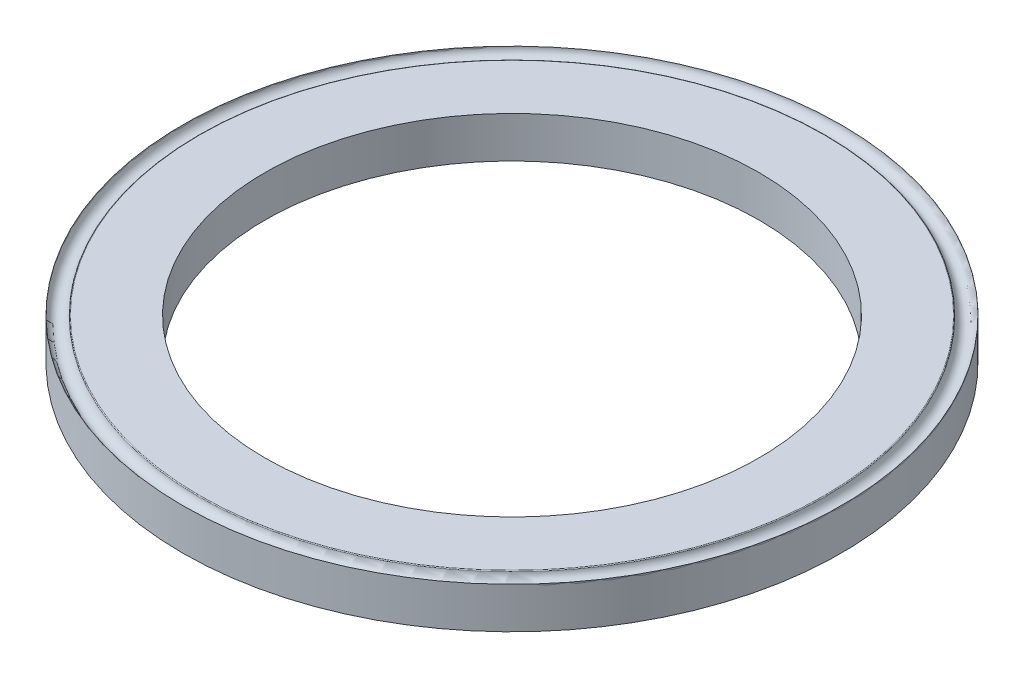
ISO-10303-21;
HEADER;
FILE_DESCRIPTION(('STEP AP214'),'2;1');
FILE_NAME('part.step','',(''),(''),'','','');
FILE_SCHEMA(('AUTOMOTIVE_DESIGN { 1 0 10303 214 1 1 1 1 }'));
ENDSEC;
DATA;
#1=APPLICATION_CONTEXT('core data for automotive mechanical design processes');
#2=APPLICATION_PROTOCOL_DEFINITION('international standard','automotive_design',2000,#1);
#3=PRODUCT_CONTEXT('',#1,'mechanical');
#4=PRODUCT('Part','Part','',(#3));
#5=PRODUCT_RELATED_PRODUCT_CATEGORY('part','',(#4));
#6=PRODUCT_DEFINITION_FORMATION('','',#4);
#7=PRODUCT_DEFINITION_CONTEXT('part definition',#1,'design');
#8=PRODUCT_DEFINITION('design','',#6,#7);
#9=PRODUCT_DEFINITION_SHAPE('','',#8);
#10=(LENGTH_UNIT() NAMED_UNIT(*) SI_UNIT(.MILLI.,.METRE.));
#11=(NAMED_UNIT(*) PLANE_ANGLE_UNIT() SI_UNIT($,.RADIAN.));
#12=(NAMED_UNIT(*) SI_UNIT($,.STERADIAN.) SOLID_ANGLE_UNIT());
#13=UNCERTAINTY_MEASURE_WITH_UNIT(LENGTH_MEASURE(1.E-05),#10,'distance_accuracy_value','');
#14=(GEOMETRIC_REPRESENTATION_CONTEXT(3) GLOBAL_UNCERTAINTY_ASSIGNED_CONTEXT((#13)) GLOBAL_UNIT_ASSIGNED_CONTEXT((#10,
#11,#12)) REPRESENTATION_CONTEXT('',''));
#15=CARTESIAN_POINT('',(0.,0.,0.));
#16=DIRECTION('',(0.,0.,1.));
#17=DIRECTION('',(1.,0.,0.));
#18=AXIS2_PLACEMENT_3D('',#15,#16,#17);
#19=CARTESIAN_POINT('',(0.,0.25,0.));
#20=DIRECTION('',(0.,1.,0.));
#21=DIRECTION('',(0.,0.,1.));
#22=AXIS2_PLACEMENT_3D('',#19,#20,#21);
#23=PLANE('',#22);
#24=CARTESIAN_POINT('',(0.,0.25,0.));
#25=DIRECTION('',(0.,1.,0.));
#26=DIRECTION('',(0.,0.,1.));
#27=AXIS2_PLACEMENT_3D('',#24,#25,#26);
#28=CIRCLE('',#27,3.79045548849897);
#29=CARTESIAN_POINT('',(0.,0.25,3.79045548849897));
#30=VERTEX_POINT('',#29);
#31=EDGE_CURVE('E58',#30,#30,#28,.T.);
#32=ORIENTED_EDGE('',*,*,#31,.T.);
#33=EDGE_LOOP('',(#32));
#34=FACE_BOUND('',#33,.T.);
#35=CARTESIAN_POINT('',(0.,0.25,0.));
#36=DIRECTION('',(0.,1.,0.));
#37=DIRECTION('',(0.,0.,1.));
#38=AXIS2_PLACEMENT_3D('',#35,#36,#37);
#39=CIRCLE('',#38,3.);
#40=CARTESIAN_POINT('',(0.,0.25,3.));
#41=VERTEX_POINT('',#40);
#42=EDGE_CURVE('E42',#41,#41,#39,.T.);
#43=ORIENTED_EDGE('',*,*,#42,.F.);
#44=EDGE_LOOP('',(#43));
#45=FACE_BOUND('',#44,.T.);
#46=ADVANCED_FACE('F35',(#34,#45),#23,.T.);
#47=CARTESIAN_POINT('',(0.,-0.25,0.));
#48=DIRECTION('',(0.,1.,0.));
#49=DIRECTION('',(0.,0.,1.));
#50=AXIS2_PLACEMENT_3D('',#47,#48,#49);
#51=PLANE('',#50);
#52=CARTESIAN_POINT('',(0.,-0.25,0.));
#53=DIRECTION('',(0.,1.,0.));
#54=DIRECTION('',(0.,0.,1.));
#55=AXIS2_PLACEMENT_3D('',#52,#53,#54);
#56=CIRCLE('',#55,4.);
#57=CARTESIAN_POINT('',(0.,-0.25,4.));
#58=VERTEX_POINT('',#57);
#59=EDGE_CURVE('E10',#58,#58,#56,.T.);
#60=ORIENTED_EDGE('',*,*,#59,.F.);
#61=EDGE_LOOP('',(#60));
#62=FACE_BOUND('',#61,.T.);
#63=CARTESIAN_POINT('',(0.,-0.25,0.));
#64=DIRECTION('',(0.,1.,0.));
#65=DIRECTION('',(0.,0.,1.));
#66=AXIS2_PLACEMENT_3D('',#63,#64,#65);
#67=CIRCLE('',#66,3.);
#68=CARTESIAN_POINT('',(0.,-0.25,3.));
#69=VERTEX_POINT('',#68);
#70=EDGE_CURVE('E46',#69,#69,#67,.T.);
#71=ORIENTED_EDGE('',*,*,#70,.T.);
#72=EDGE_LOOP('',(#71));
#73=FACE_BOUND('',#72,.T.);
#74=ADVANCED_FACE('F78',(#62,#73),#51,.F.);
#75=CARTESIAN_POINT('',(0.,0.25,0.));
#76=DIRECTION('',(0.,-1.,0.));
#77=DIRECTION('',(0.,0.,-1.));
#78=AXIS2_PLACEMENT_3D('',#75,#76,#77);
#79=CYLINDRICAL_SURFACE('',#78,4.);
#80=CARTESIAN_POINT('',(0.,0.25,0.));
#81=DIRECTION('',(0.,1.,0.));
#82=DIRECTION('',(0.,0.,1.));
#83=AXIS2_PLACEMENT_3D('',#80,#81,#82);
#84=CIRCLE('',#83,4.);
#85=CARTESIAN_POINT('',(0.,0.25,4.));
#86=VERTEX_POINT('',#85);
#87=EDGE_CURVE('E55',#86,#86,#84,.T.);
#88=ORIENTED_EDGE('',*,*,#87,.F.);
#89=EDGE_LOOP('',(#88));
#90=FACE_BOUND('',#89,.T.);
#91=ORIENTED_EDGE('',*,*,#59,.T.);
#92=EDGE_LOOP('',(#91));
#93=FACE_BOUND('',#92,.T.);
#94=ADVANCED_FACE('F37',(#90,#93),#79,.T.);
#95=CARTESIAN_POINT('',(0.,0.25,0.));
#96=DIRECTION('',(0.,-1.,0.));
#97=DIRECTION('',(0.,0.,-1.));
#98=AXIS2_PLACEMENT_3D('',#95,#96,#97);
#99=CYLINDRICAL_SURFACE('',#98,3.);
#100=ORIENTED_EDGE('',*,*,#42,.T.);
#101=EDGE_LOOP('',(#100));
#102=FACE_BOUND('',#101,.T.);
#103=ORIENTED_EDGE('',*,*,#70,.F.);
#104=EDGE_LOOP('',(#103));
#105=FACE_BOUND('',#104,.T.);
#106=ADVANCED_FACE('F68',(#102,#105),#99,.F.);
#107=CARTESIAN_POINT('',(0.,0.24,0.));
#108=DIRECTION('',(0.,1.,0.));
#109=DIRECTION('',(0.,0.,1.));
#110=AXIS2_PLACEMENT_3D('',#107,#108,#109);
#111=TOROIDAL_SURFACE('',#110,3.79045548849897,0.01);
#112=ORIENTED_EDGE('',*,*,#31,.F.);
#113=EDGE_LOOP('',(#112));
#114=FACE_BOUND('',#113,.T.);
#115=CARTESIAN_POINT('',(0.,0.240909090909091,0.));
#116=DIRECTION('',(0.,1.,0.));
#117=DIRECTION('',(0.,0.,1.));
#118=AXIS2_PLACEMENT_3D('',#115,#116,#117);
#119=CIRCLE('',#118,3.80041408045361);
#120=CARTESIAN_POINT('',(0.,0.240909090909091,3.80041408045361));
#121=VERTEX_POINT('',#120);
#122=EDGE_CURVE('E51',#121,#121,#119,.T.);
#123=ORIENTED_EDGE('',*,*,#122,.T.);
#124=EDGE_LOOP('',(#123));
#125=FACE_BOUND('',#124,.T.);
#126=ADVANCED_FACE('F64',(#114,#125),#111,.T.);
#127=CARTESIAN_POINT('',(0.,0.25,0.));
#128=DIRECTION('',(0.,1.,0.));
#129=DIRECTION('',(0.,0.,1.));
#130=AXIS2_PLACEMENT_3D('',#127,#128,#129);
#131=TOROIDAL_SURFACE('',#130,3.9,0.1);
#132=ORIENTED_EDGE('',*,*,#122,.F.);
#133=EDGE_LOOP('',(#132));
#134=FACE_BOUND('',#133,.T.);
#135=ORIENTED_EDGE('',*,*,#87,.T.);
#136=EDGE_LOOP('',(#135));
#137=FACE_BOUND('',#136,.T.);
#138=ADVANCED_FACE('F67',(#134,#137),#131,.F.);
#139=CLOSED_SHELL('',(#46,#74,#94,#106,#126,#138));
#140=MANIFOLD_SOLID_BREP('B2',#139);
#141=ADVANCED_BREP_SHAPE_REPRESENTATION('',(#18,#140),#14);
#142=SHAPE_DEFINITION_REPRESENTATION(#9,#141);
ENDSEC;
END-ISO-10303-21;
